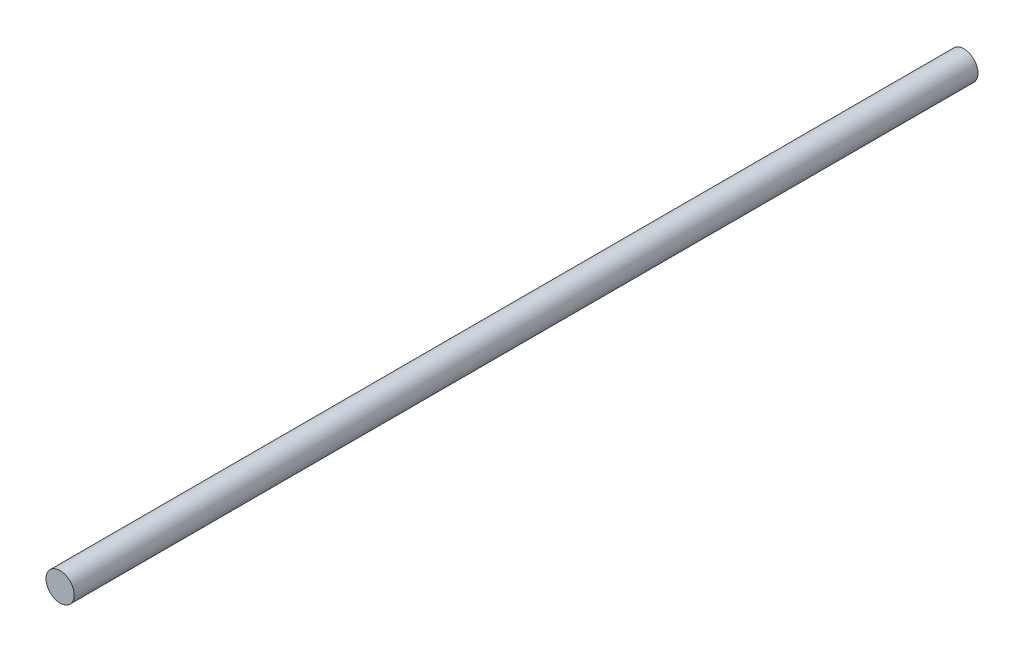
ISO-10303-21;
HEADER;
FILE_DESCRIPTION(('STEP AP214'),'2;1');
FILE_NAME('part.step','',(''),(''),'','','');
FILE_SCHEMA(('AUTOMOTIVE_DESIGN { 1 0 10303 214 1 1 1 1 }'));
ENDSEC;
DATA;
#1=APPLICATION_CONTEXT('core data for automotive mechanical design processes');
#2=APPLICATION_PROTOCOL_DEFINITION('international standard','automotive_design',2000,#1);
#3=PRODUCT_CONTEXT('',#1,'mechanical');
#4=PRODUCT('Part','Part','',(#3));
#5=PRODUCT_RELATED_PRODUCT_CATEGORY('part','',(#4));
#6=PRODUCT_DEFINITION_FORMATION('','',#4);
#7=PRODUCT_DEFINITION_CONTEXT('part definition',#1,'design');
#8=PRODUCT_DEFINITION('design','',#6,#7);
#9=PRODUCT_DEFINITION_SHAPE('','',#8);
#10=(LENGTH_UNIT() NAMED_UNIT(*) SI_UNIT(.MILLI.,.METRE.));
#11=(NAMED_UNIT(*) PLANE_ANGLE_UNIT() SI_UNIT($,.RADIAN.));
#12=(NAMED_UNIT(*) SI_UNIT($,.STERADIAN.) SOLID_ANGLE_UNIT());
#13=UNCERTAINTY_MEASURE_WITH_UNIT(LENGTH_MEASURE(1.E-05),#10,'distance_accuracy_value','');
#14=(GEOMETRIC_REPRESENTATION_CONTEXT(3) GLOBAL_UNCERTAINTY_ASSIGNED_CONTEXT((#13)) GLOBAL_UNIT_ASSIGNED_CONTEXT((#10,
#11,#12)) REPRESENTATION_CONTEXT('',''));
#15=CARTESIAN_POINT('',(0.,0.,0.));
#16=DIRECTION('',(0.,0.,1.));
#17=DIRECTION('',(1.,0.,0.));
#18=AXIS2_PLACEMENT_3D('',#15,#16,#17);
#19=CARTESIAN_POINT('',(0.,0.,203.2));
#20=DIRECTION('',(0.,0.,-1.));
#21=DIRECTION('',(-1.,0.,0.));
#22=AXIS2_PLACEMENT_3D('',#19,#20,#21);
#23=CYLINDRICAL_SURFACE('',#22,3.175);
#24=CARTESIAN_POINT('',(0.,0.,203.2));
#25=DIRECTION('',(0.,0.,1.));
#26=DIRECTION('',(1.,0.,0.));
#27=AXIS2_PLACEMENT_3D('',#24,#25,#26);
#28=CIRCLE('',#27,3.175);
#29=CARTESIAN_POINT('',(3.175,0.,203.2));
#30=VERTEX_POINT('',#29);
#31=EDGE_CURVE('E10',#30,#30,#28,.T.);
#32=ORIENTED_EDGE('',*,*,#31,.F.);
#33=EDGE_LOOP('',(#32));
#34=FACE_BOUND('',#33,.T.);
#35=CARTESIAN_POINT('',(0.,0.,0.));
#36=DIRECTION('',(0.,0.,1.));
#37=DIRECTION('',(1.,0.,0.));
#38=AXIS2_PLACEMENT_3D('',#35,#36,#37);
#39=CIRCLE('',#38,3.175);
#40=CARTESIAN_POINT('',(3.175,0.,0.));
#41=VERTEX_POINT('',#40);
#42=EDGE_CURVE('E44',#41,#41,#39,.T.);
#43=ORIENTED_EDGE('',*,*,#42,.T.);
#44=EDGE_LOOP('',(#43));
#45=FACE_BOUND('',#44,.T.);
#46=ADVANCED_FACE('F41',(#34,#45),#23,.T.);
#47=CARTESIAN_POINT('',(0.,0.,203.2));
#48=DIRECTION('',(0.,0.,1.));
#49=DIRECTION('',(1.,0.,0.));
#50=AXIS2_PLACEMENT_3D('',#47,#48,#49);
#51=PLANE('',#50);
#52=ORIENTED_EDGE('',*,*,#31,.T.);
#53=EDGE_LOOP('',(#52));
#54=FACE_BOUND('',#53,.T.);
#55=ADVANCED_FACE('F58',(#54),#51,.T.);
#56=CARTESIAN_POINT('',(0.,0.,0.));
#57=DIRECTION('',(0.,0.,1.));
#58=DIRECTION('',(1.,0.,0.));
#59=AXIS2_PLACEMENT_3D('',#56,#57,#58);
#60=PLANE('',#59);
#61=ORIENTED_EDGE('',*,*,#42,.F.);
#62=EDGE_LOOP('',(#61));
#63=FACE_BOUND('',#62,.T.);
#64=ADVANCED_FACE('F56',(#63),#60,.F.);
#65=CLOSED_SHELL('',(#46,#55,#64));
#66=MANIFOLD_SOLID_BREP('B2',#65);
#67=ADVANCED_BREP_SHAPE_REPRESENTATION('',(#18,#66),#14);
#68=SHAPE_DEFINITION_REPRESENTATION(#9,#67);
ENDSEC;
END-ISO-10303-21;
